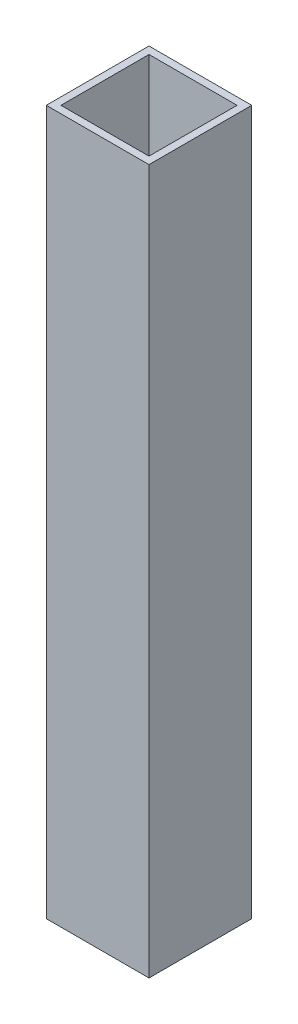
ISO-10303-21;
HEADER;
FILE_DESCRIPTION(('STEP AP214'),'2;1');
FILE_NAME('part.step','',(''),(''),'','','');
FILE_SCHEMA(('AUTOMOTIVE_DESIGN { 1 0 10303 214 1 1 1 1 }'));
ENDSEC;
DATA;
#1=APPLICATION_CONTEXT('core data for automotive mechanical design processes');
#2=APPLICATION_PROTOCOL_DEFINITION('international standard','automotive_design',2000,#1);
#3=PRODUCT_CONTEXT('',#1,'mechanical');
#4=PRODUCT('Part','Part','',(#3));
#5=PRODUCT_RELATED_PRODUCT_CATEGORY('part','',(#4));
#6=PRODUCT_DEFINITION_FORMATION('','',#4);
#7=PRODUCT_DEFINITION_CONTEXT('part definition',#1,'design');
#8=PRODUCT_DEFINITION('design','',#6,#7);
#9=PRODUCT_DEFINITION_SHAPE('','',#8);
#10=(LENGTH_UNIT() NAMED_UNIT(*) SI_UNIT(.MILLI.,.METRE.));
#11=(NAMED_UNIT(*) PLANE_ANGLE_UNIT() SI_UNIT($,.RADIAN.));
#12=(NAMED_UNIT(*) SI_UNIT($,.STERADIAN.) SOLID_ANGLE_UNIT());
#13=UNCERTAINTY_MEASURE_WITH_UNIT(LENGTH_MEASURE(1.E-05),#10,'distance_accuracy_value','');
#14=(GEOMETRIC_REPRESENTATION_CONTEXT(3) GLOBAL_UNCERTAINTY_ASSIGNED_CONTEXT((#13)) GLOBAL_UNIT_ASSIGNED_CONTEXT((#10,
#11,#12)) REPRESENTATION_CONTEXT('',''));
#15=CARTESIAN_POINT('',(0.,0.,0.));
#16=DIRECTION('',(0.,0.,1.));
#17=DIRECTION('',(1.,0.,0.));
#18=AXIS2_PLACEMENT_3D('',#15,#16,#17);
#19=CARTESIAN_POINT('',(22.225,-304.8,-323.900178003311));
#20=DIRECTION('',(0.,0.,1.));
#21=DIRECTION('',(1.,0.,0.));
#22=AXIS2_PLACEMENT_3D('',#19,#20,#21);
#23=PLANE('',#22);
#24=DIRECTION('',(1.,0.,0.));
#25=VECTOR('',#24,1.);
#26=CARTESIAN_POINT('',(22.225,0.,-323.900178003311));
#27=LINE('',#26,#25);
#28=CARTESIAN_POINT('',(0.,0.,-323.900178003311));
#29=VERTEX_POINT('',#28);
#30=CARTESIAN_POINT('',(44.45,0.,-323.900178003311));
#31=VERTEX_POINT('',#30);
#32=EDGE_CURVE('E168',#29,#31,#27,.T.);
#33=ORIENTED_EDGE('',*,*,#32,.F.);
#34=DIRECTION('',(0.,1.,0.));
#35=VECTOR('',#34,1.);
#36=CARTESIAN_POINT('',(0.,-304.8,-323.900178003311));
#37=LINE('',#36,#35);
#38=CARTESIAN_POINT('',(0.,-304.8,-323.900178003311));
#39=VERTEX_POINT('',#38);
#40=EDGE_CURVE('E9',#39,#29,#37,.T.);
#41=ORIENTED_EDGE('',*,*,#40,.F.);
#42=DIRECTION('',(1.,0.,0.));
#43=VECTOR('',#42,1.);
#44=CARTESIAN_POINT('',(22.225,-304.8,-323.900178003311));
#45=LINE('',#44,#43);
#46=CARTESIAN_POINT('',(44.45,-304.8,-323.900178003311));
#47=VERTEX_POINT('',#46);
#48=EDGE_CURVE('E123',#39,#47,#45,.T.);
#49=ORIENTED_EDGE('',*,*,#48,.T.);
#50=DIRECTION('',(0.,1.,0.));
#51=VECTOR('',#50,1.);
#52=CARTESIAN_POINT('',(44.45,-304.8,-323.900178003311));
#53=LINE('',#52,#51);
#54=EDGE_CURVE('E39',#47,#31,#53,.T.);
#55=ORIENTED_EDGE('',*,*,#54,.T.);
#56=EDGE_LOOP('',(#33,#41,#49,#55));
#57=FACE_BOUND('',#56,.T.);
#58=ADVANCED_FACE('F14',(#57),#23,.T.);
#59=CARTESIAN_POINT('',(0.,-304.8,-346.125178003311));
#60=DIRECTION('',(1.,0.,0.));
#61=DIRECTION('',(0.,0.,-1.));
#62=AXIS2_PLACEMENT_3D('',#59,#60,#61);
#63=PLANE('',#62);
#64=DIRECTION('',(0.,0.,-1.));
#65=VECTOR('',#64,1.);
#66=CARTESIAN_POINT('',(0.,0.,-346.125178003311));
#67=LINE('',#66,#65);
#68=CARTESIAN_POINT('',(0.,0.,-368.350178003311));
#69=VERTEX_POINT('',#68);
#70=EDGE_CURVE('E129',#29,#69,#67,.T.);
#71=ORIENTED_EDGE('',*,*,#70,.T.);
#72=DIRECTION('',(0.,1.,0.));
#73=VECTOR('',#72,1.);
#74=CARTESIAN_POINT('',(0.,-304.8,-368.350178003311));
#75=LINE('',#74,#73);
#76=CARTESIAN_POINT('',(0.,-304.8,-368.350178003311));
#77=VERTEX_POINT('',#76);
#78=EDGE_CURVE('E25',#77,#69,#75,.T.);
#79=ORIENTED_EDGE('',*,*,#78,.F.);
#80=DIRECTION('',(0.,0.,-1.));
#81=VECTOR('',#80,1.);
#82=CARTESIAN_POINT('',(0.,-304.8,-346.125178003311));
#83=LINE('',#82,#81);
#84=EDGE_CURVE('E118',#39,#77,#83,.T.);
#85=ORIENTED_EDGE('',*,*,#84,.F.);
#86=ORIENTED_EDGE('',*,*,#40,.T.);
#87=EDGE_LOOP('',(#71,#79,#85,#86));
#88=FACE_BOUND('',#87,.T.);
#89=ADVANCED_FACE('F127',(#88),#63,.F.);
#90=CARTESIAN_POINT('',(22.225,-304.8,-368.350178003311));
#91=DIRECTION('',(0.,0.,1.));
#92=DIRECTION('',(1.,0.,0.));
#93=AXIS2_PLACEMENT_3D('',#90,#91,#92);
#94=PLANE('',#93);
#95=DIRECTION('',(1.,0.,0.));
#96=VECTOR('',#95,1.);
#97=CARTESIAN_POINT('',(22.225,0.,-368.350178003311));
#98=LINE('',#97,#96);
#99=CARTESIAN_POINT('',(44.45,0.,-368.350178003311));
#100=VERTEX_POINT('',#99);
#101=EDGE_CURVE('E163',#69,#100,#98,.T.);
#102=ORIENTED_EDGE('',*,*,#101,.T.);
#103=DIRECTION('',(0.,1.,0.));
#104=VECTOR('',#103,1.);
#105=CARTESIAN_POINT('',(44.45,-304.8,-368.350178003311));
#106=LINE('',#105,#104);
#107=CARTESIAN_POINT('',(44.45,-304.8,-368.350178003311));
#108=VERTEX_POINT('',#107);
#109=EDGE_CURVE('E74',#108,#100,#106,.T.);
#110=ORIENTED_EDGE('',*,*,#109,.F.);
#111=DIRECTION('',(1.,0.,0.));
#112=VECTOR('',#111,1.);
#113=CARTESIAN_POINT('',(22.225,-304.8,-368.350178003311));
#114=LINE('',#113,#112);
#115=EDGE_CURVE('E109',#77,#108,#114,.T.);
#116=ORIENTED_EDGE('',*,*,#115,.F.);
#117=ORIENTED_EDGE('',*,*,#78,.T.);
#118=EDGE_LOOP('',(#102,#110,#116,#117));
#119=FACE_BOUND('',#118,.T.);
#120=ADVANCED_FACE('F111',(#119),#94,.F.);
#121=CARTESIAN_POINT('',(3.175,-304.8,-346.125178003311));
#122=DIRECTION('',(1.,0.,0.));
#123=DIRECTION('',(0.,0.,-1.));
#124=AXIS2_PLACEMENT_3D('',#121,#122,#123);
#125=PLANE('',#124);
#126=DIRECTION('',(0.,0.,-1.));
#127=VECTOR('',#126,1.);
#128=CARTESIAN_POINT('',(3.175,0.,-346.125178003311));
#129=LINE('',#128,#127);
#130=CARTESIAN_POINT('',(3.175,0.,-327.075178003311));
#131=VERTEX_POINT('',#130);
#132=CARTESIAN_POINT('',(3.175,0.,-365.175178003311));
#133=VERTEX_POINT('',#132);
#134=EDGE_CURVE('E181',#131,#133,#129,.T.);
#135=ORIENTED_EDGE('',*,*,#134,.F.);
#136=DIRECTION('',(0.,1.,0.));
#137=VECTOR('',#136,1.);
#138=CARTESIAN_POINT('',(3.175,-304.8,-327.075178003311));
#139=LINE('',#138,#137);
#140=CARTESIAN_POINT('',(3.175,-304.8,-327.075178003311));
#141=VERTEX_POINT('',#140);
#142=EDGE_CURVE('E18',#141,#131,#139,.T.);
#143=ORIENTED_EDGE('',*,*,#142,.F.);
#144=DIRECTION('',(0.,0.,-1.));
#145=VECTOR('',#144,1.);
#146=CARTESIAN_POINT('',(3.175,-304.8,-346.125178003311));
#147=LINE('',#146,#145);
#148=CARTESIAN_POINT('',(3.175,-304.8,-365.175178003311));
#149=VERTEX_POINT('',#148);
#150=EDGE_CURVE('E162',#141,#149,#147,.T.);
#151=ORIENTED_EDGE('',*,*,#150,.T.);
#152=DIRECTION('',(0.,1.,0.));
#153=VECTOR('',#152,1.);
#154=CARTESIAN_POINT('',(3.175,-304.8,-365.175178003311));
#155=LINE('',#154,#153);
#156=EDGE_CURVE('E138',#149,#133,#155,.T.);
#157=ORIENTED_EDGE('',*,*,#156,.T.);
#158=EDGE_LOOP('',(#135,#143,#151,#157));
#159=FACE_BOUND('',#158,.T.);
#160=ADVANCED_FACE('F16',(#159),#125,.T.);
#161=CARTESIAN_POINT('',(22.225,-304.8,-327.075178003311));
#162=DIRECTION('',(0.,0.,1.));
#163=DIRECTION('',(1.,0.,0.));
#164=AXIS2_PLACEMENT_3D('',#161,#162,#163);
#165=PLANE('',#164);
#166=DIRECTION('',(1.,0.,0.));
#167=VECTOR('',#166,1.);
#168=CARTESIAN_POINT('',(22.225,0.,-327.075178003311));
#169=LINE('',#168,#167);
#170=CARTESIAN_POINT('',(41.275,0.,-327.075178003311));
#171=VERTEX_POINT('',#170);
#172=EDGE_CURVE('E178',#131,#171,#169,.T.);
#173=ORIENTED_EDGE('',*,*,#172,.T.);
#174=DIRECTION('',(0.,1.,0.));
#175=VECTOR('',#174,1.);
#176=CARTESIAN_POINT('',(41.275,-304.8,-327.075178003311));
#177=LINE('',#176,#175);
#178=CARTESIAN_POINT('',(41.275,-304.8,-327.075178003311));
#179=VERTEX_POINT('',#178);
#180=EDGE_CURVE('E143',#179,#171,#177,.T.);
#181=ORIENTED_EDGE('',*,*,#180,.F.);
#182=DIRECTION('',(1.,0.,0.));
#183=VECTOR('',#182,1.);
#184=CARTESIAN_POINT('',(22.225,-304.8,-327.075178003311));
#185=LINE('',#184,#183);
#186=EDGE_CURVE('E196',#141,#179,#185,.T.);
#187=ORIENTED_EDGE('',*,*,#186,.F.);
#188=ORIENTED_EDGE('',*,*,#142,.T.);
#189=EDGE_LOOP('',(#173,#181,#187,#188));
#190=FACE_BOUND('',#189,.T.);
#191=ADVANCED_FACE('F211',(#190),#165,.F.);
#192=CARTESIAN_POINT('',(41.275,-304.8,-346.125178003311));
#193=DIRECTION('',(1.,0.,0.));
#194=DIRECTION('',(0.,0.,-1.));
#195=AXIS2_PLACEMENT_3D('',#192,#193,#194);
#196=PLANE('',#195);
#197=DIRECTION('',(0.,0.,-1.));
#198=VECTOR('',#197,1.);
#199=CARTESIAN_POINT('',(41.275,0.,-346.125178003311));
#200=LINE('',#199,#198);
#201=CARTESIAN_POINT('',(41.275,0.,-365.175178003311));
#202=VERTEX_POINT('',#201);
#203=EDGE_CURVE('E175',#171,#202,#200,.T.);
#204=ORIENTED_EDGE('',*,*,#203,.T.);
#205=DIRECTION('',(0.,1.,0.));
#206=VECTOR('',#205,1.);
#207=CARTESIAN_POINT('',(41.275,-304.8,-365.175178003311));
#208=LINE('',#207,#206);
#209=CARTESIAN_POINT('',(41.275,-304.8,-365.175178003311));
#210=VERTEX_POINT('',#209);
#211=EDGE_CURVE('E141',#210,#202,#208,.T.);
#212=ORIENTED_EDGE('',*,*,#211,.F.);
#213=DIRECTION('',(0.,0.,-1.));
#214=VECTOR('',#213,1.);
#215=CARTESIAN_POINT('',(41.275,-304.8,-346.125178003311));
#216=LINE('',#215,#214);
#217=EDGE_CURVE('E193',#179,#210,#216,.T.);
#218=ORIENTED_EDGE('',*,*,#217,.F.);
#219=ORIENTED_EDGE('',*,*,#180,.T.);
#220=EDGE_LOOP('',(#204,#212,#218,#219));
#221=FACE_BOUND('',#220,.T.);
#222=ADVANCED_FACE('F212',(#221),#196,.F.);
#223=CARTESIAN_POINT('',(22.225,-304.8,-365.175178003311));
#224=DIRECTION('',(0.,0.,1.));
#225=DIRECTION('',(1.,0.,0.));
#226=AXIS2_PLACEMENT_3D('',#223,#224,#225);
#227=PLANE('',#226);
#228=DIRECTION('',(1.,0.,0.));
#229=VECTOR('',#228,1.);
#230=CARTESIAN_POINT('',(22.225,0.,-365.175178003311));
#231=LINE('',#230,#229);
#232=EDGE_CURVE('E171',#133,#202,#231,.T.);
#233=ORIENTED_EDGE('',*,*,#232,.F.);
#234=ORIENTED_EDGE('',*,*,#156,.F.);
#235=DIRECTION('',(1.,0.,0.));
#236=VECTOR('',#235,1.);
#237=CARTESIAN_POINT('',(22.225,-304.8,-365.175178003311));
#238=LINE('',#237,#236);
#239=EDGE_CURVE('E189',#149,#210,#238,.T.);
#240=ORIENTED_EDGE('',*,*,#239,.T.);
#241=ORIENTED_EDGE('',*,*,#211,.T.);
#242=EDGE_LOOP('',(#233,#234,#240,#241));
#243=FACE_BOUND('',#242,.T.);
#244=ADVANCED_FACE('F207',(#243),#227,.T.);
#245=CARTESIAN_POINT('',(44.45,-304.8,-346.125178003311));
#246=DIRECTION('',(1.,0.,0.));
#247=DIRECTION('',(0.,0.,-1.));
#248=AXIS2_PLACEMENT_3D('',#245,#246,#247);
#249=PLANE('',#248);
#250=DIRECTION('',(0.,0.,-1.));
#251=VECTOR('',#250,1.);
#252=CARTESIAN_POINT('',(44.45,0.,-346.125178003311));
#253=LINE('',#252,#251);
#254=EDGE_CURVE('E158',#31,#100,#253,.T.);
#255=ORIENTED_EDGE('',*,*,#254,.F.);
#256=ORIENTED_EDGE('',*,*,#54,.F.);
#257=DIRECTION('',(0.,0.,-1.));
#258=VECTOR('',#257,1.);
#259=CARTESIAN_POINT('',(44.45,-304.8,-346.125178003311));
#260=LINE('',#259,#258);
#261=EDGE_CURVE('E117',#47,#108,#260,.T.);
#262=ORIENTED_EDGE('',*,*,#261,.T.);
#263=ORIENTED_EDGE('',*,*,#109,.T.);
#264=EDGE_LOOP('',(#255,#256,#262,#263));
#265=FACE_BOUND('',#264,.T.);
#266=ADVANCED_FACE('F220',(#265),#249,.T.);
#267=CARTESIAN_POINT('',(22.225,-304.8,-346.125178003311));
#268=DIRECTION('',(0.,-1.,0.));
#269=DIRECTION('',(1.,0.,0.));
#270=AXIS2_PLACEMENT_3D('',#267,#268,#269);
#271=PLANE('',#270);
#272=ORIENTED_EDGE('',*,*,#150,.F.);
#273=ORIENTED_EDGE('',*,*,#186,.T.);
#274=ORIENTED_EDGE('',*,*,#217,.T.);
#275=ORIENTED_EDGE('',*,*,#239,.F.);
#276=EDGE_LOOP('',(#272,#273,#274,#275));
#277=FACE_BOUND('',#276,.T.);
#278=ORIENTED_EDGE('',*,*,#48,.F.);
#279=ORIENTED_EDGE('',*,*,#84,.T.);
#280=ORIENTED_EDGE('',*,*,#115,.T.);
#281=ORIENTED_EDGE('',*,*,#261,.F.);
#282=EDGE_LOOP('',(#278,#279,#280,#281));
#283=FACE_BOUND('',#282,.T.);
#284=ADVANCED_FACE('F122',(#277,#283),#271,.T.);
#285=CARTESIAN_POINT('',(22.225,0.,-346.125178003311));
#286=DIRECTION('',(0.,-1.,0.));
#287=DIRECTION('',(1.,0.,0.));
#288=AXIS2_PLACEMENT_3D('',#285,#286,#287);
#289=PLANE('',#288);
#290=ORIENTED_EDGE('',*,*,#134,.T.);
#291=ORIENTED_EDGE('',*,*,#232,.T.);
#292=ORIENTED_EDGE('',*,*,#203,.F.);
#293=ORIENTED_EDGE('',*,*,#172,.F.);
#294=EDGE_LOOP('',(#290,#291,#292,#293));
#295=FACE_BOUND('',#294,.T.);
#296=ORIENTED_EDGE('',*,*,#32,.T.);
#297=ORIENTED_EDGE('',*,*,#254,.T.);
#298=ORIENTED_EDGE('',*,*,#101,.F.);
#299=ORIENTED_EDGE('',*,*,#70,.F.);
#300=EDGE_LOOP('',(#296,#297,#298,#299));
#301=FACE_BOUND('',#300,.T.);
#302=ADVANCED_FACE('F209',(#295,#301),#289,.F.);
#303=CLOSED_SHELL('',(#58,#89,#120,#160,#191,#222,#244,#266,#284,#302));
#304=MANIFOLD_SOLID_BREP('B1',#303);
#305=ADVANCED_BREP_SHAPE_REPRESENTATION('',(#18,#304),#14);
#306=SHAPE_DEFINITION_REPRESENTATION(#9,#305);
ENDSEC;
END-ISO-10303-21;
